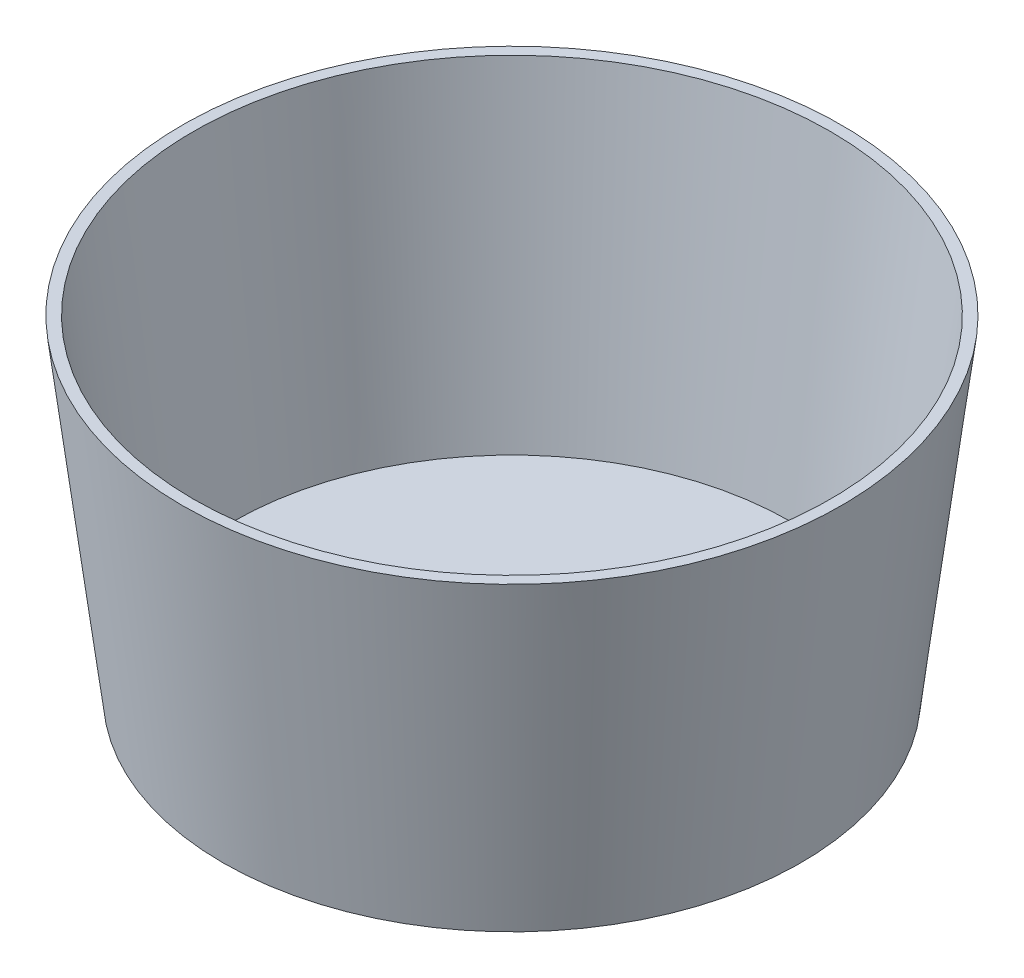
ISO-10303-21;
HEADER;
FILE_DESCRIPTION(('STEP AP214'),'2;1');
FILE_NAME('part.step','',(''),(''),'','','');
FILE_SCHEMA(('AUTOMOTIVE_DESIGN { 1 0 10303 214 1 1 1 1 }'));
ENDSEC;
DATA;
#1=APPLICATION_CONTEXT('core data for automotive mechanical design processes');
#2=APPLICATION_PROTOCOL_DEFINITION('international standard','automotive_design',2000,#1);
#3=PRODUCT_CONTEXT('',#1,'mechanical');
#4=PRODUCT('Part','Part','',(#3));
#5=PRODUCT_RELATED_PRODUCT_CATEGORY('part','',(#4));
#6=PRODUCT_DEFINITION_FORMATION('','',#4);
#7=PRODUCT_DEFINITION_CONTEXT('part definition',#1,'design');
#8=PRODUCT_DEFINITION('design','',#6,#7);
#9=PRODUCT_DEFINITION_SHAPE('','',#8);
#10=(LENGTH_UNIT() NAMED_UNIT(*) SI_UNIT(.MILLI.,.METRE.));
#11=(NAMED_UNIT(*) PLANE_ANGLE_UNIT() SI_UNIT($,.RADIAN.));
#12=(NAMED_UNIT(*) SI_UNIT($,.STERADIAN.) SOLID_ANGLE_UNIT());
#13=UNCERTAINTY_MEASURE_WITH_UNIT(LENGTH_MEASURE(1.E-05),#10,'distance_accuracy_value','');
#14=(GEOMETRIC_REPRESENTATION_CONTEXT(3) GLOBAL_UNCERTAINTY_ASSIGNED_CONTEXT((#13)) GLOBAL_UNIT_ASSIGNED_CONTEXT((#10,
#11,#12)) REPRESENTATION_CONTEXT('',''));
#15=CARTESIAN_POINT('',(0.,0.,0.));
#16=DIRECTION('',(0.,0.,1.));
#17=DIRECTION('',(1.,0.,0.));
#18=AXIS2_PLACEMENT_3D('',#15,#16,#17);
#19=CARTESIAN_POINT('',(0.,0.,0.));
#20=DIRECTION('',(0.,1.,0.));
#21=DIRECTION('',(0.,0.,1.));
#22=AXIS2_PLACEMENT_3D('',#19,#20,#21);
#23=CONICAL_SURFACE('',#22,300.,0.122173047639603);
#24=CARTESIAN_POINT('',(0.,-300.,0.));
#25=DIRECTION('',(0.,1.,0.));
#26=DIRECTION('',(0.,0.,1.));
#27=AXIS2_PLACEMENT_3D('',#24,#25,#26);
#28=CIRCLE('',#27,263.164631729129);
#29=CARTESIAN_POINT('',(0.,-300.,263.164631729129));
#30=VERTEX_POINT('',#29);
#31=EDGE_CURVE('E10',#30,#30,#28,.T.);
#32=ORIENTED_EDGE('',*,*,#31,.T.);
#33=EDGE_LOOP('',(#32));
#34=FACE_BOUND('',#33,.T.);
#35=CARTESIAN_POINT('',(0.,0.,0.));
#36=DIRECTION('',(0.,1.,0.));
#37=DIRECTION('',(0.,0.,1.));
#38=AXIS2_PLACEMENT_3D('',#35,#36,#37);
#39=CIRCLE('',#38,300.);
#40=CARTESIAN_POINT('',(0.,0.,300.));
#41=VERTEX_POINT('',#40);
#42=EDGE_CURVE('E41',#41,#41,#39,.T.);
#43=ORIENTED_EDGE('',*,*,#42,.F.);
#44=EDGE_LOOP('',(#43));
#45=FACE_BOUND('',#44,.T.);
#46=ADVANCED_FACE('F35',(#34,#45),#23,.T.);
#47=CARTESIAN_POINT('',(0.,-300.,0.));
#48=DIRECTION('',(0.,1.,0.));
#49=DIRECTION('',(0.,0.,1.));
#50=AXIS2_PLACEMENT_3D('',#47,#48,#49);
#51=PLANE('',#50);
#52=ORIENTED_EDGE('',*,*,#31,.F.);
#53=EDGE_LOOP('',(#52));
#54=FACE_BOUND('',#53,.T.);
#55=ADVANCED_FACE('F59',(#54),#51,.F.);
#56=CARTESIAN_POINT('',(0.,0.,0.));
#57=DIRECTION('',(0.,1.,0.));
#58=DIRECTION('',(0.,0.,1.));
#59=AXIS2_PLACEMENT_3D('',#56,#57,#58);
#60=PLANE('',#59);
#61=CARTESIAN_POINT('',(0.,0.,0.));
#62=DIRECTION('',(0.,1.,0.));
#63=DIRECTION('',(0.,0.,1.));
#64=AXIS2_PLACEMENT_3D('',#61,#62,#63);
#65=CIRCLE('',#64,289.924901745412);
#66=CARTESIAN_POINT('',(0.,0.,289.924901745412));
#67=VERTEX_POINT('',#66);
#68=EDGE_CURVE('E49',#67,#67,#65,.T.);
#69=ORIENTED_EDGE('',*,*,#68,.F.);
#70=EDGE_LOOP('',(#69));
#71=FACE_BOUND('',#70,.T.);
#72=ORIENTED_EDGE('',*,*,#42,.T.);
#73=EDGE_LOOP('',(#72));
#74=FACE_BOUND('',#73,.T.);
#75=ADVANCED_FACE('F57',(#71,#74),#60,.T.);
#76=CARTESIAN_POINT('',(0.,1.21869343405148,0.));
#77=DIRECTION('',(0.,1.,0.));
#78=DIRECTION('',(0.,0.,1.));
#79=AXIS2_PLACEMENT_3D('',#76,#77,#78);
#80=CONICAL_SURFACE('',#79,290.074538483587,0.122173047639603);
#81=CARTESIAN_POINT('',(0.,-290.,0.));
#82=DIRECTION('',(0.,1.,0.));
#83=DIRECTION('',(0.,0.,1.));
#84=AXIS2_PLACEMENT_3D('',#81,#82,#83);
#85=CIRCLE('',#84,254.317379083569);
#86=CARTESIAN_POINT('',(0.,-290.,254.317379083569));
#87=VERTEX_POINT('',#86);
#88=EDGE_CURVE('E45',#87,#87,#85,.T.);
#89=ORIENTED_EDGE('',*,*,#88,.F.);
#90=EDGE_LOOP('',(#89));
#91=FACE_BOUND('',#90,.T.);
#92=ORIENTED_EDGE('',*,*,#68,.T.);
#93=EDGE_LOOP('',(#92));
#94=FACE_BOUND('',#93,.T.);
#95=ADVANCED_FACE('F55',(#91,#94),#80,.F.);
#96=CARTESIAN_POINT('',(0.,-290.,0.));
#97=DIRECTION('',(0.,1.,0.));
#98=DIRECTION('',(0.,0.,1.));
#99=AXIS2_PLACEMENT_3D('',#96,#97,#98);
#100=PLANE('',#99);
#101=ORIENTED_EDGE('',*,*,#88,.T.);
#102=EDGE_LOOP('',(#101));
#103=FACE_BOUND('',#102,.T.);
#104=ADVANCED_FACE('F64',(#103),#100,.T.);
#105=CLOSED_SHELL('',(#46,#55,#75,#95,#104));
#106=MANIFOLD_SOLID_BREP('B2',#105);
#107=ADVANCED_BREP_SHAPE_REPRESENTATION('',(#18,#106),#14);
#108=SHAPE_DEFINITION_REPRESENTATION(#9,#107);
ENDSEC;
END-ISO-10303-21;
